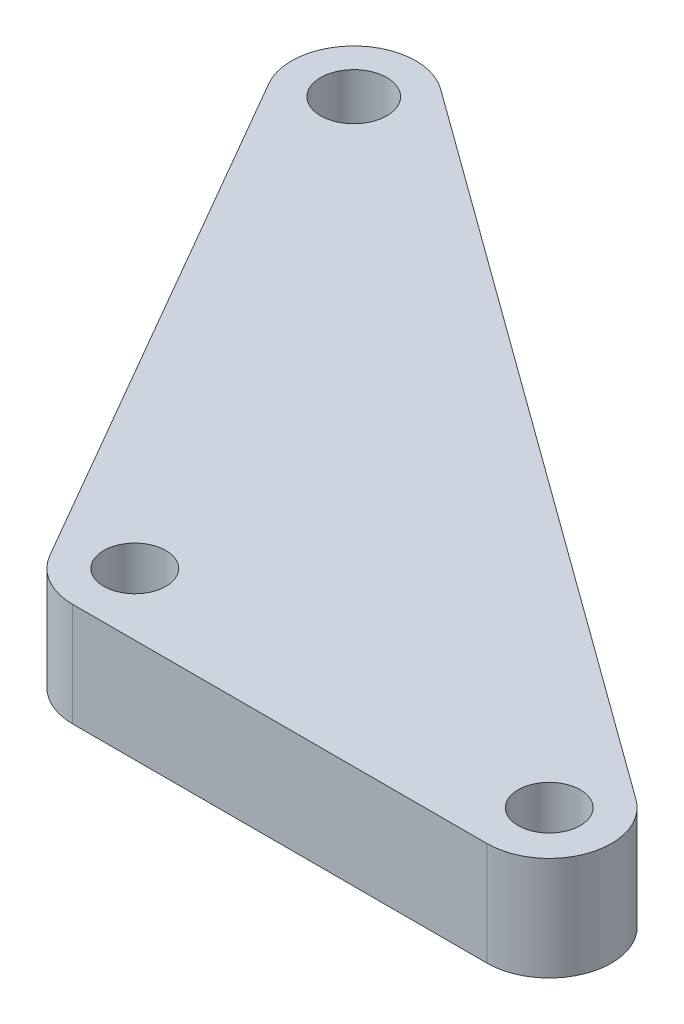
ISO-10303-21;
HEADER;
FILE_DESCRIPTION(('STEP AP214'),'2;1');
FILE_NAME('part.step','',(''),(''),'','','');
FILE_SCHEMA(('AUTOMOTIVE_DESIGN { 1 0 10303 214 1 1 1 1 }'));
ENDSEC;
DATA;
#1=APPLICATION_CONTEXT('core data for automotive mechanical design processes');
#2=APPLICATION_PROTOCOL_DEFINITION('international standard','automotive_design',2000,#1);
#3=PRODUCT_CONTEXT('',#1,'mechanical');
#4=PRODUCT('Part','Part','',(#3));
#5=PRODUCT_RELATED_PRODUCT_CATEGORY('part','',(#4));
#6=PRODUCT_DEFINITION_FORMATION('','',#4);
#7=PRODUCT_DEFINITION_CONTEXT('part definition',#1,'design');
#8=PRODUCT_DEFINITION('design','',#6,#7);
#9=PRODUCT_DEFINITION_SHAPE('','',#8);
#10=(LENGTH_UNIT() NAMED_UNIT(*) SI_UNIT(.MILLI.,.METRE.));
#11=(NAMED_UNIT(*) PLANE_ANGLE_UNIT() SI_UNIT($,.RADIAN.));
#12=(NAMED_UNIT(*) SI_UNIT($,.STERADIAN.) SOLID_ANGLE_UNIT());
#13=UNCERTAINTY_MEASURE_WITH_UNIT(LENGTH_MEASURE(1.E-05),#10,'distance_accuracy_value','');
#14=(GEOMETRIC_REPRESENTATION_CONTEXT(3) GLOBAL_UNCERTAINTY_ASSIGNED_CONTEXT((#13)) GLOBAL_UNIT_ASSIGNED_CONTEXT((#10,
#11,#12)) REPRESENTATION_CONTEXT('',''));
#15=CARTESIAN_POINT('',(0.,0.,0.));
#16=DIRECTION('',(0.,0.,1.));
#17=DIRECTION('',(1.,0.,0.));
#18=AXIS2_PLACEMENT_3D('',#15,#16,#17);
#19=CARTESIAN_POINT('',(0.,5.,0.));
#20=DIRECTION('',(0.,1.,0.));
#21=DIRECTION('',(0.,0.,1.));
#22=AXIS2_PLACEMENT_3D('',#19,#20,#21);
#23=PLANE('',#22);
#24=CARTESIAN_POINT('',(14.4337567297407,5.,25.));
#25=DIRECTION('',(0.,1.,0.));
#26=DIRECTION('',(0.,0.,1.));
#27=AXIS2_PLACEMENT_3D('',#24,#25,#26);
#28=CIRCLE('',#27,1.5);
#29=CARTESIAN_POINT('',(14.4337567297407,5.,26.5));
#30=VERTEX_POINT('',#29);
#31=EDGE_CURVE('E157',#30,#30,#28,.T.);
#32=ORIENTED_EDGE('',*,*,#31,.F.);
#33=EDGE_LOOP('',(#32));
#34=FACE_BOUND('',#33,.T.);
#35=DIRECTION('',(1.,0.,0.));
#36=VECTOR('',#35,1.);
#37=CARTESIAN_POINT('',(12.7017059221718,5.,28.));
#38=LINE('',#37,#36);
#39=CARTESIAN_POINT('',(14.4337567297407,5.,28.));
#40=VERTEX_POINT('',#39);
#41=CARTESIAN_POINT('',(34.4337567297407,5.,28.));
#42=VERTEX_POINT('',#41);
#43=EDGE_CURVE('E127',#40,#42,#38,.T.);
#44=ORIENTED_EDGE('',*,*,#43,.T.);
#45=CARTESIAN_POINT('',(34.4337567297407,5.,25.));
#46=DIRECTION('',(0.,1.,0.));
#47=DIRECTION('',(0.,0.,1.));
#48=AXIS2_PLACEMENT_3D('',#45,#46,#47);
#49=CIRCLE('',#48,3.);
#50=CARTESIAN_POINT('',(36.1963007767133,5.,22.5723594824436));
#51=VERTEX_POINT('',#50);
#52=EDGE_CURVE('E140',#42,#51,#49,.T.);
#53=ORIENTED_EDGE('',*,*,#52,.T.);
#54=DIRECTION('',(-0.809213505852118,0.,-0.587514682324216));
#55=VECTOR('',#54,1.);
#56=CARTESIAN_POINT('',(-9.64922400373252,5.,-10.7129462280779));
#57=LINE('',#56,#55);
#58=CARTESIAN_POINT('',(1.76254404697265,5.,-2.42764051755635));
#59=VERTEX_POINT('',#58);
#60=EDGE_CURVE('E111',#51,#59,#57,.T.);
#61=ORIENTED_EDGE('',*,*,#60,.T.);
#62=CARTESIAN_POINT('',(0.,5.,0.));
#63=DIRECTION('',(0.,1.,0.));
#64=DIRECTION('',(0.,0.,1.));
#65=AXIS2_PLACEMENT_3D('',#62,#63,#64);
#66=CIRCLE('',#65,3.);
#67=CARTESIAN_POINT('',(-2.59807621135331,5.,1.50000000000001));
#68=VERTEX_POINT('',#67);
#69=EDGE_CURVE('E59',#59,#68,#66,.T.);
#70=ORIENTED_EDGE('',*,*,#69,.T.);
#71=DIRECTION('',(0.500000000000001,0.,0.866025403784438));
#72=VECTOR('',#71,1.);
#73=CARTESIAN_POINT('',(-9.64922400373252,5.,-10.7129462280779));
#74=LINE('',#73,#72);
#75=CARTESIAN_POINT('',(11.8356805183874,5.,26.5));
#76=VERTEX_POINT('',#75);
#77=EDGE_CURVE('E144',#68,#76,#74,.T.);
#78=ORIENTED_EDGE('',*,*,#77,.T.);
#79=CARTESIAN_POINT('',(14.4337567297407,5.,25.));
#80=DIRECTION('',(0.,1.,0.));
#81=DIRECTION('',(0.,0.,1.));
#82=AXIS2_PLACEMENT_3D('',#79,#80,#81);
#83=CIRCLE('',#82,3.);
#84=EDGE_CURVE('E138',#76,#40,#83,.T.);
#85=ORIENTED_EDGE('',*,*,#84,.T.);
#86=EDGE_LOOP('',(#44,#53,#61,#70,#78,#85));
#87=FACE_BOUND('',#86,.T.);
#88=CARTESIAN_POINT('',(0.,5.,0.));
#89=DIRECTION('',(0.,1.,0.));
#90=DIRECTION('',(0.,0.,1.));
#91=AXIS2_PLACEMENT_3D('',#88,#89,#90);
#92=CIRCLE('',#91,1.6);
#93=CARTESIAN_POINT('',(0.,5.,1.6));
#94=VERTEX_POINT('',#93);
#95=EDGE_CURVE('E119',#94,#94,#92,.T.);
#96=ORIENTED_EDGE('',*,*,#95,.F.);
#97=EDGE_LOOP('',(#96));
#98=FACE_BOUND('',#97,.T.);
#99=CARTESIAN_POINT('',(34.4337567297407,5.,25.));
#100=DIRECTION('',(0.,1.,0.));
#101=DIRECTION('',(0.,0.,1.));
#102=AXIS2_PLACEMENT_3D('',#99,#100,#101);
#103=CIRCLE('',#102,1.50000000000001);
#104=CARTESIAN_POINT('',(34.4337567297407,5.,26.5));
#105=VERTEX_POINT('',#104);
#106=EDGE_CURVE('E162',#105,#105,#103,.T.);
#107=ORIENTED_EDGE('',*,*,#106,.F.);
#108=EDGE_LOOP('',(#107));
#109=FACE_BOUND('',#108,.T.);
#110=ADVANCED_FACE('F39',(#34,#87,#98,#109),#23,.T.);
#111=CARTESIAN_POINT('',(0.,0.,0.));
#112=DIRECTION('',(0.,1.,0.));
#113=DIRECTION('',(0.,0.,1.));
#114=AXIS2_PLACEMENT_3D('',#111,#112,#113);
#115=PLANE('',#114);
#116=DIRECTION('',(-0.809213505852118,0.,-0.587514682324216));
#117=VECTOR('',#116,1.);
#118=CARTESIAN_POINT('',(-9.64922400373252,0.,-10.7129462280779));
#119=LINE('',#118,#117);
#120=CARTESIAN_POINT('',(36.1963007767133,0.,22.5723594824436));
#121=VERTEX_POINT('',#120);
#122=CARTESIAN_POINT('',(1.76254404697265,0.,-2.42764051755635));
#123=VERTEX_POINT('',#122);
#124=EDGE_CURVE('E109',#121,#123,#119,.T.);
#125=ORIENTED_EDGE('',*,*,#124,.F.);
#126=CARTESIAN_POINT('',(34.4337567297407,0.,25.));
#127=DIRECTION('',(0.,1.,0.));
#128=DIRECTION('',(0.,0.,1.));
#129=AXIS2_PLACEMENT_3D('',#126,#127,#128);
#130=CIRCLE('',#129,3.);
#131=CARTESIAN_POINT('',(34.4337567297407,0.,28.));
#132=VERTEX_POINT('',#131);
#133=EDGE_CURVE('E92',#121,#132,#130,.F.);
#134=ORIENTED_EDGE('',*,*,#133,.T.);
#135=DIRECTION('',(1.,0.,0.));
#136=VECTOR('',#135,1.);
#137=CARTESIAN_POINT('',(12.7017059221718,0.,28.));
#138=LINE('',#137,#136);
#139=CARTESIAN_POINT('',(14.4337567297407,0.,28.));
#140=VERTEX_POINT('',#139);
#141=EDGE_CURVE('E121',#140,#132,#138,.T.);
#142=ORIENTED_EDGE('',*,*,#141,.F.);
#143=CARTESIAN_POINT('',(14.4337567297407,0.,25.));
#144=DIRECTION('',(0.,1.,0.));
#145=DIRECTION('',(0.,0.,1.));
#146=AXIS2_PLACEMENT_3D('',#143,#144,#145);
#147=CIRCLE('',#146,3.);
#148=CARTESIAN_POINT('',(11.8356805183874,0.,26.5));
#149=VERTEX_POINT('',#148);
#150=EDGE_CURVE('E103',#140,#149,#147,.F.);
#151=ORIENTED_EDGE('',*,*,#150,.T.);
#152=DIRECTION('',(0.500000000000001,0.,0.866025403784438));
#153=VECTOR('',#152,1.);
#154=CARTESIAN_POINT('',(-9.64922400373252,0.,-10.7129462280779));
#155=LINE('',#154,#153);
#156=CARTESIAN_POINT('',(-2.59807621135331,0.,1.50000000000001));
#157=VERTEX_POINT('',#156);
#158=EDGE_CURVE('E118',#157,#149,#155,.T.);
#159=ORIENTED_EDGE('',*,*,#158,.F.);
#160=CARTESIAN_POINT('',(0.,0.,0.));
#161=DIRECTION('',(0.,1.,0.));
#162=DIRECTION('',(0.,0.,1.));
#163=AXIS2_PLACEMENT_3D('',#160,#161,#162);
#164=CIRCLE('',#163,3.);
#165=EDGE_CURVE('E112',#157,#123,#164,.F.);
#166=ORIENTED_EDGE('',*,*,#165,.T.);
#167=EDGE_LOOP('',(#125,#134,#142,#151,#159,#166));
#168=FACE_BOUND('',#167,.T.);
#169=CARTESIAN_POINT('',(0.,0.,0.));
#170=DIRECTION('',(0.,1.,0.));
#171=DIRECTION('',(0.,0.,1.));
#172=AXIS2_PLACEMENT_3D('',#169,#170,#171);
#173=CIRCLE('',#172,1.6);
#174=CARTESIAN_POINT('',(0.,0.,1.6));
#175=VERTEX_POINT('',#174);
#176=EDGE_CURVE('E124',#175,#175,#173,.T.);
#177=ORIENTED_EDGE('',*,*,#176,.T.);
#178=EDGE_LOOP('',(#177));
#179=FACE_BOUND('',#178,.T.);
#180=CARTESIAN_POINT('',(14.4337567297407,0.,25.));
#181=DIRECTION('',(0.,1.,0.));
#182=DIRECTION('',(0.,0.,1.));
#183=AXIS2_PLACEMENT_3D('',#180,#181,#182);
#184=CIRCLE('',#183,1.5);
#185=CARTESIAN_POINT('',(14.4337567297407,0.,26.5));
#186=VERTEX_POINT('',#185);
#187=EDGE_CURVE('E159',#186,#186,#184,.T.);
#188=ORIENTED_EDGE('',*,*,#187,.T.);
#189=EDGE_LOOP('',(#188));
#190=FACE_BOUND('',#189,.T.);
#191=CARTESIAN_POINT('',(34.4337567297407,0.,25.));
#192=DIRECTION('',(0.,1.,0.));
#193=DIRECTION('',(0.,0.,1.));
#194=AXIS2_PLACEMENT_3D('',#191,#192,#193);
#195=CIRCLE('',#194,1.50000000000001);
#196=CARTESIAN_POINT('',(34.4337567297407,0.,26.5));
#197=VERTEX_POINT('',#196);
#198=EDGE_CURVE('E165',#197,#197,#195,.T.);
#199=ORIENTED_EDGE('',*,*,#198,.T.);
#200=EDGE_LOOP('',(#199));
#201=FACE_BOUND('',#200,.T.);
#202=ADVANCED_FACE('F115',(#168,#179,#190,#201),#115,.F.);
#203=CARTESIAN_POINT('',(-9.64922400373252,5.,-10.7129462280779));
#204=DIRECTION('',(-0.587514682324216,0.,0.809213505852118));
#205=DIRECTION('',(0.809213505852118,0.,0.587514682324216));
#206=AXIS2_PLACEMENT_3D('',#203,#204,#205);
#207=PLANE('',#206);
#208=ORIENTED_EDGE('',*,*,#60,.F.);
#209=DIRECTION('',(0.,-1.,0.));
#210=VECTOR('',#209,1.);
#211=CARTESIAN_POINT('',(36.1963007767133,5.,22.5723594824436));
#212=LINE('',#211,#210);
#213=EDGE_CURVE('E96',#51,#121,#212,.T.);
#214=ORIENTED_EDGE('',*,*,#213,.T.);
#215=ORIENTED_EDGE('',*,*,#124,.T.);
#216=DIRECTION('',(0.,-1.,0.));
#217=VECTOR('',#216,1.);
#218=CARTESIAN_POINT('',(1.76254404697265,5.,-2.42764051755635));
#219=LINE('',#218,#217);
#220=EDGE_CURVE('E113',#123,#59,#219,.F.);
#221=ORIENTED_EDGE('',*,*,#220,.T.);
#222=EDGE_LOOP('',(#208,#214,#215,#221));
#223=FACE_BOUND('',#222,.T.);
#224=ADVANCED_FACE('F108',(#223),#207,.F.);
#225=CARTESIAN_POINT('',(-9.64922400373252,5.,-10.7129462280779));
#226=DIRECTION('',(0.866025403784438,0.,-0.500000000000001));
#227=DIRECTION('',(-0.500000000000001,0.,-0.866025403784438));
#228=AXIS2_PLACEMENT_3D('',#225,#226,#227);
#229=PLANE('',#228);
#230=ORIENTED_EDGE('',*,*,#158,.T.);
#231=DIRECTION('',(0.,-1.,0.));
#232=VECTOR('',#231,1.);
#233=CARTESIAN_POINT('',(11.8356805183874,5.,26.5));
#234=LINE('',#233,#232);
#235=EDGE_CURVE('E11',#149,#76,#234,.F.);
#236=ORIENTED_EDGE('',*,*,#235,.T.);
#237=ORIENTED_EDGE('',*,*,#77,.F.);
#238=DIRECTION('',(0.,-1.,0.));
#239=VECTOR('',#238,1.);
#240=CARTESIAN_POINT('',(-2.59807621135331,5.,1.50000000000001));
#241=LINE('',#240,#239);
#242=EDGE_CURVE('E47',#68,#157,#241,.T.);
#243=ORIENTED_EDGE('',*,*,#242,.T.);
#244=EDGE_LOOP('',(#230,#236,#237,#243));
#245=FACE_BOUND('',#244,.T.);
#246=ADVANCED_FACE('F143',(#245),#229,.F.);
#247=CARTESIAN_POINT('',(12.7017059221718,5.,28.));
#248=DIRECTION('',(0.,0.,-1.));
#249=DIRECTION('',(-1.,0.,0.));
#250=AXIS2_PLACEMENT_3D('',#247,#248,#249);
#251=PLANE('',#250);
#252=ORIENTED_EDGE('',*,*,#141,.T.);
#253=DIRECTION('',(0.,-1.,0.));
#254=VECTOR('',#253,1.);
#255=CARTESIAN_POINT('',(34.4337567297407,5.,28.));
#256=LINE('',#255,#254);
#257=EDGE_CURVE('E97',#132,#42,#256,.F.);
#258=ORIENTED_EDGE('',*,*,#257,.T.);
#259=ORIENTED_EDGE('',*,*,#43,.F.);
#260=DIRECTION('',(0.,-1.,0.));
#261=VECTOR('',#260,1.);
#262=CARTESIAN_POINT('',(14.4337567297407,5.,28.));
#263=LINE('',#262,#261);
#264=EDGE_CURVE('E102',#40,#140,#263,.T.);
#265=ORIENTED_EDGE('',*,*,#264,.T.);
#266=EDGE_LOOP('',(#252,#258,#259,#265));
#267=FACE_BOUND('',#266,.T.);
#268=ADVANCED_FACE('F152',(#267),#251,.F.);
#269=CARTESIAN_POINT('',(0.,5.,0.));
#270=DIRECTION('',(0.,-1.,0.));
#271=DIRECTION('',(0.,0.,-1.));
#272=AXIS2_PLACEMENT_3D('',#269,#270,#271);
#273=CYLINDRICAL_SURFACE('',#272,1.6);
#274=ORIENTED_EDGE('',*,*,#95,.T.);
#275=EDGE_LOOP('',(#274));
#276=FACE_BOUND('',#275,.T.);
#277=ORIENTED_EDGE('',*,*,#176,.F.);
#278=EDGE_LOOP('',(#277));
#279=FACE_BOUND('',#278,.T.);
#280=ADVANCED_FACE('F184',(#276,#279),#273,.F.);
#281=CARTESIAN_POINT('',(14.4337567297407,5.,25.));
#282=DIRECTION('',(0.,-1.,0.));
#283=DIRECTION('',(0.,0.,-1.));
#284=AXIS2_PLACEMENT_3D('',#281,#282,#283);
#285=CYLINDRICAL_SURFACE('',#284,1.5);
#286=ORIENTED_EDGE('',*,*,#31,.T.);
#287=EDGE_LOOP('',(#286));
#288=FACE_BOUND('',#287,.T.);
#289=ORIENTED_EDGE('',*,*,#187,.F.);
#290=EDGE_LOOP('',(#289));
#291=FACE_BOUND('',#290,.T.);
#292=ADVANCED_FACE('F205',(#288,#291),#285,.F.);
#293=CARTESIAN_POINT('',(34.4337567297407,5.,25.));
#294=DIRECTION('',(0.,-1.,0.));
#295=DIRECTION('',(0.,0.,-1.));
#296=AXIS2_PLACEMENT_3D('',#293,#294,#295);
#297=CYLINDRICAL_SURFACE('',#296,1.50000000000001);
#298=ORIENTED_EDGE('',*,*,#106,.T.);
#299=EDGE_LOOP('',(#298));
#300=FACE_BOUND('',#299,.T.);
#301=ORIENTED_EDGE('',*,*,#198,.F.);
#302=EDGE_LOOP('',(#301));
#303=FACE_BOUND('',#302,.T.);
#304=ADVANCED_FACE('F171',(#300,#303),#297,.F.);
#305=CARTESIAN_POINT('',(34.4337567297407,5.,25.));
#306=DIRECTION('',(0.,-1.,0.));
#307=DIRECTION('',(0.,0.,-1.));
#308=AXIS2_PLACEMENT_3D('',#305,#306,#307);
#309=CYLINDRICAL_SURFACE('',#308,3.);
#310=ORIENTED_EDGE('',*,*,#52,.F.);
#311=ORIENTED_EDGE('',*,*,#257,.F.);
#312=ORIENTED_EDGE('',*,*,#133,.F.);
#313=ORIENTED_EDGE('',*,*,#213,.F.);
#314=EDGE_LOOP('',(#310,#311,#312,#313));
#315=FACE_BOUND('',#314,.T.);
#316=ADVANCED_FACE('F95',(#315),#309,.T.);
#317=CARTESIAN_POINT('',(14.4337567297407,5.,25.));
#318=DIRECTION('',(0.,-1.,0.));
#319=DIRECTION('',(0.,0.,-1.));
#320=AXIS2_PLACEMENT_3D('',#317,#318,#319);
#321=CYLINDRICAL_SURFACE('',#320,3.);
#322=ORIENTED_EDGE('',*,*,#84,.F.);
#323=ORIENTED_EDGE('',*,*,#235,.F.);
#324=ORIENTED_EDGE('',*,*,#150,.F.);
#325=ORIENTED_EDGE('',*,*,#264,.F.);
#326=EDGE_LOOP('',(#322,#323,#324,#325));
#327=FACE_BOUND('',#326,.T.);
#328=ADVANCED_FACE('F149',(#327),#321,.T.);
#329=CARTESIAN_POINT('',(0.,5.,0.));
#330=DIRECTION('',(0.,-1.,0.));
#331=DIRECTION('',(0.,0.,-1.));
#332=AXIS2_PLACEMENT_3D('',#329,#330,#331);
#333=CYLINDRICAL_SURFACE('',#332,3.);
#334=ORIENTED_EDGE('',*,*,#69,.F.);
#335=ORIENTED_EDGE('',*,*,#220,.F.);
#336=ORIENTED_EDGE('',*,*,#165,.F.);
#337=ORIENTED_EDGE('',*,*,#242,.F.);
#338=EDGE_LOOP('',(#334,#335,#336,#337));
#339=FACE_BOUND('',#338,.T.);
#340=ADVANCED_FACE('F41',(#339),#333,.T.);
#341=CLOSED_SHELL('',(#110,#202,#224,#246,#268,#280,#292,#304,#316,#328,#340));
#342=MANIFOLD_SOLID_BREP('B2',#341);
#343=ADVANCED_BREP_SHAPE_REPRESENTATION('',(#18,#342),#14);
#344=SHAPE_DEFINITION_REPRESENTATION(#9,#343);
ENDSEC;
END-ISO-10303-21;
